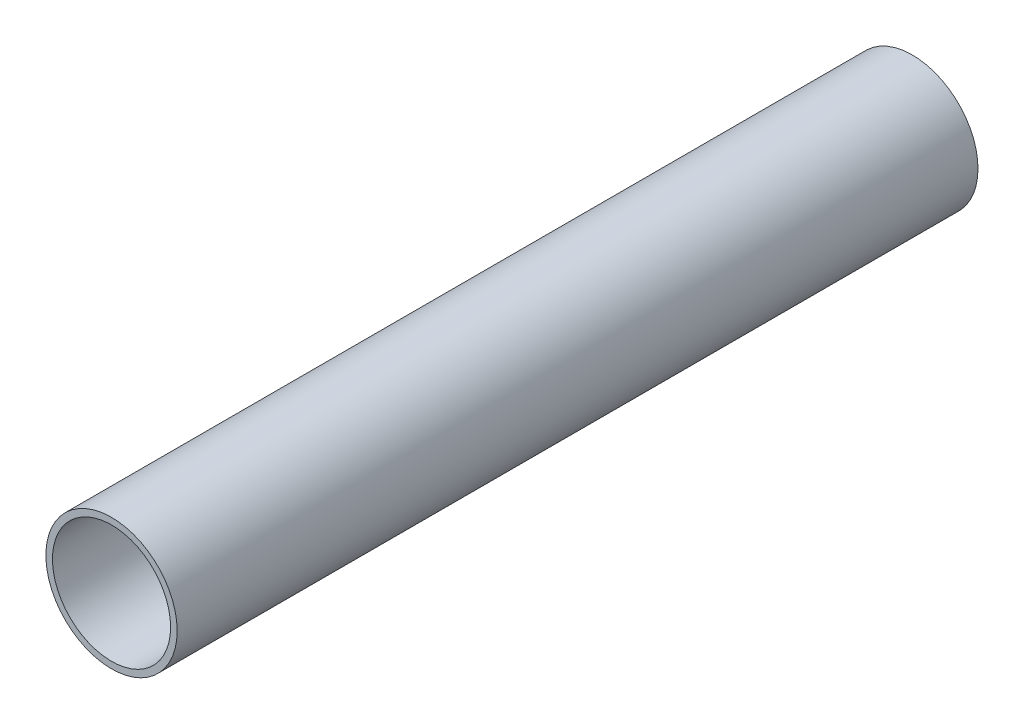
ISO-10303-21;
HEADER;
FILE_DESCRIPTION(('STEP AP214'),'2;1');
FILE_NAME('part.step','',(''),(''),'','','');
FILE_SCHEMA(('AUTOMOTIVE_DESIGN { 1 0 10303 214 1 1 1 1 }'));
ENDSEC;
DATA;
#1=APPLICATION_CONTEXT('core data for automotive mechanical design processes');
#2=APPLICATION_PROTOCOL_DEFINITION('international standard','automotive_design',2000,#1);
#3=PRODUCT_CONTEXT('',#1,'mechanical');
#4=PRODUCT('Part','Part','',(#3));
#5=PRODUCT_RELATED_PRODUCT_CATEGORY('part','',(#4));
#6=PRODUCT_DEFINITION_FORMATION('','',#4);
#7=PRODUCT_DEFINITION_CONTEXT('part definition',#1,'design');
#8=PRODUCT_DEFINITION('design','',#6,#7);
#9=PRODUCT_DEFINITION_SHAPE('','',#8);
#10=(LENGTH_UNIT() NAMED_UNIT(*) SI_UNIT(.MILLI.,.METRE.));
#11=(NAMED_UNIT(*) PLANE_ANGLE_UNIT() SI_UNIT($,.RADIAN.));
#12=(NAMED_UNIT(*) SI_UNIT($,.STERADIAN.) SOLID_ANGLE_UNIT());
#13=UNCERTAINTY_MEASURE_WITH_UNIT(LENGTH_MEASURE(1.E-05),#10,'distance_accuracy_value','');
#14=(GEOMETRIC_REPRESENTATION_CONTEXT(3) GLOBAL_UNCERTAINTY_ASSIGNED_CONTEXT((#13)) GLOBAL_UNIT_ASSIGNED_CONTEXT((#10,
#11,#12)) REPRESENTATION_CONTEXT('',''));
#15=CARTESIAN_POINT('',(0.,0.,0.));
#16=DIRECTION('',(0.,0.,1.));
#17=DIRECTION('',(1.,0.,0.));
#18=AXIS2_PLACEMENT_3D('',#15,#16,#17);
#19=CARTESIAN_POINT('',(0.,0.,122.));
#20=DIRECTION('',(0.,0.,1.));
#21=DIRECTION('',(1.,0.,0.));
#22=AXIS2_PLACEMENT_3D('',#19,#20,#21);
#23=PLANE('',#22);
#24=CARTESIAN_POINT('',(0.,0.,122.));
#25=DIRECTION('',(0.,0.,1.));
#26=DIRECTION('',(1.,0.,0.));
#27=AXIS2_PLACEMENT_3D('',#24,#25,#26);
#28=CIRCLE('',#27,10.);
#29=CARTESIAN_POINT('',(10.,0.,122.));
#30=VERTEX_POINT('',#29);
#31=EDGE_CURVE('E11',#30,#30,#28,.T.);
#32=ORIENTED_EDGE('',*,*,#31,.T.);
#33=EDGE_LOOP('',(#32));
#34=FACE_BOUND('',#33,.T.);
#35=CARTESIAN_POINT('',(0.,0.,122.));
#36=DIRECTION('',(0.,0.,1.));
#37=DIRECTION('',(1.,0.,0.));
#38=AXIS2_PLACEMENT_3D('',#35,#36,#37);
#39=CIRCLE('',#38,9.);
#40=CARTESIAN_POINT('',(9.,0.,122.));
#41=VERTEX_POINT('',#40);
#42=EDGE_CURVE('E51',#41,#41,#39,.T.);
#43=ORIENTED_EDGE('',*,*,#42,.F.);
#44=EDGE_LOOP('',(#43));
#45=FACE_BOUND('',#44,.T.);
#46=ADVANCED_FACE('F40',(#34,#45),#23,.T.);
#47=CARTESIAN_POINT('',(0.,0.,0.));
#48=DIRECTION('',(0.,0.,1.));
#49=DIRECTION('',(1.,0.,0.));
#50=AXIS2_PLACEMENT_3D('',#47,#48,#49);
#51=PLANE('',#50);
#52=CARTESIAN_POINT('',(0.,0.,0.));
#53=DIRECTION('',(0.,0.,1.));
#54=DIRECTION('',(1.,0.,0.));
#55=AXIS2_PLACEMENT_3D('',#52,#53,#54);
#56=CIRCLE('',#55,10.);
#57=CARTESIAN_POINT('',(10.,0.,0.));
#58=VERTEX_POINT('',#57);
#59=EDGE_CURVE('E44',#58,#58,#56,.T.);
#60=ORIENTED_EDGE('',*,*,#59,.F.);
#61=EDGE_LOOP('',(#60));
#62=FACE_BOUND('',#61,.T.);
#63=CARTESIAN_POINT('',(0.,0.,0.));
#64=DIRECTION('',(0.,0.,1.));
#65=DIRECTION('',(1.,0.,0.));
#66=AXIS2_PLACEMENT_3D('',#63,#64,#65);
#67=CIRCLE('',#66,9.);
#68=CARTESIAN_POINT('',(9.,0.,0.));
#69=VERTEX_POINT('',#68);
#70=EDGE_CURVE('E53',#69,#69,#67,.T.);
#71=ORIENTED_EDGE('',*,*,#70,.T.);
#72=EDGE_LOOP('',(#71));
#73=FACE_BOUND('',#72,.T.);
#74=ADVANCED_FACE('F63',(#62,#73),#51,.F.);
#75=CARTESIAN_POINT('',(0.,0.,122.));
#76=DIRECTION('',(0.,0.,-1.));
#77=DIRECTION('',(-1.,0.,0.));
#78=AXIS2_PLACEMENT_3D('',#75,#76,#77);
#79=CYLINDRICAL_SURFACE('',#78,10.);
#80=ORIENTED_EDGE('',*,*,#31,.F.);
#81=EDGE_LOOP('',(#80));
#82=FACE_BOUND('',#81,.T.);
#83=ORIENTED_EDGE('',*,*,#59,.T.);
#84=EDGE_LOOP('',(#83));
#85=FACE_BOUND('',#84,.T.);
#86=ADVANCED_FACE('F42',(#82,#85),#79,.T.);
#87=CARTESIAN_POINT('',(0.,0.,122.));
#88=DIRECTION('',(0.,0.,-1.));
#89=DIRECTION('',(-1.,0.,0.));
#90=AXIS2_PLACEMENT_3D('',#87,#88,#89);
#91=CYLINDRICAL_SURFACE('',#90,9.);
#92=ORIENTED_EDGE('',*,*,#42,.T.);
#93=EDGE_LOOP('',(#92));
#94=FACE_BOUND('',#93,.T.);
#95=ORIENTED_EDGE('',*,*,#70,.F.);
#96=EDGE_LOOP('',(#95));
#97=FACE_BOUND('',#96,.T.);
#98=ADVANCED_FACE('F59',(#94,#97),#91,.F.);
#99=CLOSED_SHELL('',(#46,#74,#86,#98));
#100=MANIFOLD_SOLID_BREP('B2',#99);
#101=ADVANCED_BREP_SHAPE_REPRESENTATION('',(#18,#100),#14);
#102=SHAPE_DEFINITION_REPRESENTATION(#9,#101);
ENDSEC;
END-ISO-10303-21;
